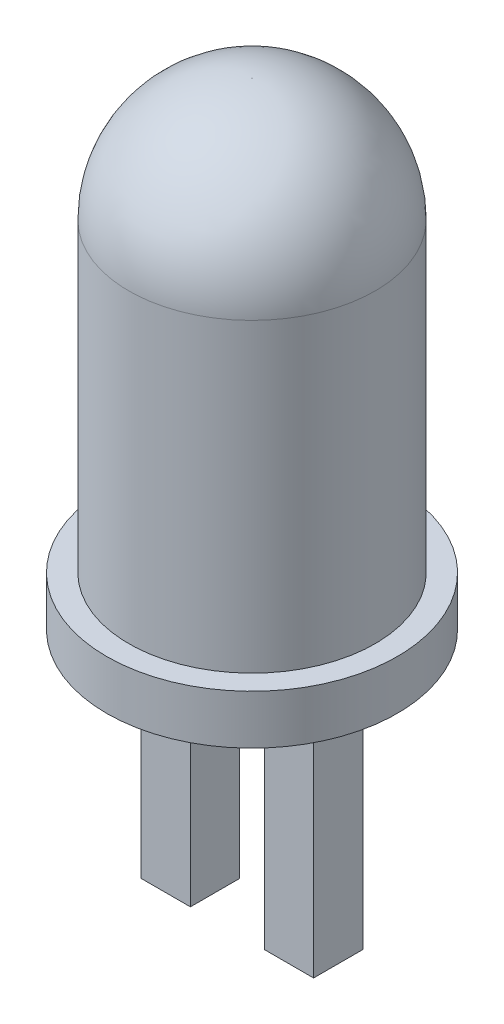
ISO-10303-21;
HEADER;
FILE_DESCRIPTION(('STEP AP214'),'2;1');
FILE_NAME('part.step','',(''),(''),'','','');
FILE_SCHEMA(('AUTOMOTIVE_DESIGN { 1 0 10303 214 1 1 1 1 }'));
ENDSEC;
DATA;
#1=APPLICATION_CONTEXT('core data for automotive mechanical design processes');
#2=APPLICATION_PROTOCOL_DEFINITION('international standard','automotive_design',2000,#1);
#3=PRODUCT_CONTEXT('',#1,'mechanical');
#4=PRODUCT('Part','Part','',(#3));
#5=PRODUCT_RELATED_PRODUCT_CATEGORY('part','',(#4));
#6=PRODUCT_DEFINITION_FORMATION('','',#4);
#7=PRODUCT_DEFINITION_CONTEXT('part definition',#1,'design');
#8=PRODUCT_DEFINITION('design','',#6,#7);
#9=PRODUCT_DEFINITION_SHAPE('','',#8);
#10=(LENGTH_UNIT() NAMED_UNIT(*) SI_UNIT(.MILLI.,.METRE.));
#11=(NAMED_UNIT(*) PLANE_ANGLE_UNIT() SI_UNIT($,.RADIAN.));
#12=(NAMED_UNIT(*) SI_UNIT($,.STERADIAN.) SOLID_ANGLE_UNIT());
#13=UNCERTAINTY_MEASURE_WITH_UNIT(LENGTH_MEASURE(1.E-05),#10,'distance_accuracy_value','');
#14=(GEOMETRIC_REPRESENTATION_CONTEXT(3) GLOBAL_UNCERTAINTY_ASSIGNED_CONTEXT((#13)) GLOBAL_UNIT_ASSIGNED_CONTEXT((#10,
#11,#12)) REPRESENTATION_CONTEXT('',''));
#15=CARTESIAN_POINT('',(0.,0.,0.));
#16=DIRECTION('',(0.,0.,1.));
#17=DIRECTION('',(1.,0.,0.));
#18=AXIS2_PLACEMENT_3D('',#15,#16,#17);
#19=CARTESIAN_POINT('',(0.,0.,0.));
#20=DIRECTION('',(0.,1.,0.));
#21=DIRECTION('',(0.,0.,1.));
#22=AXIS2_PLACEMENT_3D('',#19,#20,#21);
#23=PLANE('',#22);
#24=DIRECTION('',(0.,0.,1.));
#25=VECTOR('',#24,1.);
#26=CARTESIAN_POINT('',(-0.749999999999999,0.,-0.5));
#27=LINE('',#26,#25);
#28=CARTESIAN_POINT('',(-0.749999999999999,0.,-0.5));
#29=VERTEX_POINT('',#28);
#30=CARTESIAN_POINT('',(-0.749999999999999,0.,0.5));
#31=VERTEX_POINT('',#30);
#32=EDGE_CURVE('E121',#29,#31,#27,.T.);
#33=ORIENTED_EDGE('',*,*,#32,.F.);
#34=DIRECTION('',(1.,0.,0.));
#35=VECTOR('',#34,1.);
#36=CARTESIAN_POINT('',(-1.75,0.,-0.5));
#37=LINE('',#36,#35);
#38=CARTESIAN_POINT('',(-1.75,0.,-0.5));
#39=VERTEX_POINT('',#38);
#40=EDGE_CURVE('E134',#39,#29,#37,.T.);
#41=ORIENTED_EDGE('',*,*,#40,.F.);
#42=DIRECTION('',(0.,0.,-1.));
#43=VECTOR('',#42,1.);
#44=CARTESIAN_POINT('',(-1.75,0.,-0.5));
#45=LINE('',#44,#43);
#46=CARTESIAN_POINT('',(-1.75,0.,0.5));
#47=VERTEX_POINT('',#46);
#48=EDGE_CURVE('E143',#47,#39,#45,.T.);
#49=ORIENTED_EDGE('',*,*,#48,.F.);
#50=DIRECTION('',(-1.,0.,0.));
#51=VECTOR('',#50,1.);
#52=CARTESIAN_POINT('',(-1.75,0.,0.5));
#53=LINE('',#52,#51);
#54=EDGE_CURVE('E124',#31,#47,#53,.T.);
#55=ORIENTED_EDGE('',*,*,#54,.F.);
#56=EDGE_LOOP('',(#33,#41,#49,#55));
#57=FACE_BOUND('',#56,.T.);
#58=CARTESIAN_POINT('',(0.,0.,0.));
#59=DIRECTION('',(0.,-1.,0.));
#60=DIRECTION('',(0.,0.,-1.));
#61=AXIS2_PLACEMENT_3D('',#58,#59,#60);
#62=CIRCLE('',#61,2.95);
#63=CARTESIAN_POINT('',(0.,0.,-2.95));
#64=VERTEX_POINT('',#63);
#65=EDGE_CURVE('E159',#64,#64,#62,.T.);
#66=ORIENTED_EDGE('',*,*,#65,.T.);
#67=EDGE_LOOP('',(#66));
#68=FACE_BOUND('',#67,.T.);
#69=DIRECTION('',(0.,0.,1.));
#70=VECTOR('',#69,1.);
#71=CARTESIAN_POINT('',(1.75,0.,-0.5));
#72=LINE('',#71,#70);
#73=CARTESIAN_POINT('',(1.75,0.,-0.5));
#74=VERTEX_POINT('',#73);
#75=CARTESIAN_POINT('',(1.75,0.,0.5));
#76=VERTEX_POINT('',#75);
#77=EDGE_CURVE('E120',#74,#76,#72,.T.);
#78=ORIENTED_EDGE('',*,*,#77,.F.);
#79=DIRECTION('',(1.,0.,0.));
#80=VECTOR('',#79,1.);
#81=CARTESIAN_POINT('',(0.750000000000001,0.,-0.5));
#82=LINE('',#81,#80);
#83=CARTESIAN_POINT('',(0.750000000000001,0.,-0.5));
#84=VERTEX_POINT('',#83);
#85=EDGE_CURVE('E117',#84,#74,#82,.T.);
#86=ORIENTED_EDGE('',*,*,#85,.F.);
#87=DIRECTION('',(0.,0.,-1.));
#88=VECTOR('',#87,1.);
#89=CARTESIAN_POINT('',(0.750000000000001,0.,-0.5));
#90=LINE('',#89,#88);
#91=CARTESIAN_POINT('',(0.750000000000001,0.,0.5));
#92=VERTEX_POINT('',#91);
#93=EDGE_CURVE('E55',#92,#84,#90,.T.);
#94=ORIENTED_EDGE('',*,*,#93,.F.);
#95=DIRECTION('',(-1.,0.,0.));
#96=VECTOR('',#95,1.);
#97=CARTESIAN_POINT('',(0.750000000000001,0.,0.5));
#98=LINE('',#97,#96);
#99=EDGE_CURVE('E50',#76,#92,#98,.T.);
#100=ORIENTED_EDGE('',*,*,#99,.F.);
#101=EDGE_LOOP('',(#78,#86,#94,#100));
#102=FACE_BOUND('',#101,.T.);
#103=ADVANCED_FACE('F36',(#57,#68,#102),#23,.F.);
#104=CARTESIAN_POINT('',(0.,9.69,0.00999999999998225));
#105=DIRECTION('',(0.,-1.,0.));
#106=DIRECTION('',(0.,0.,-1.));
#107=AXIS2_PLACEMENT_3D('',#104,#105,#106);
#108=PLANE('',#107);
#109=CARTESIAN_POINT('',(0.,9.69,0.));
#110=DIRECTION('',(0.,-1.,0.));
#111=DIRECTION('',(0.,0.,-1.));
#112=AXIS2_PLACEMENT_3D('',#109,#110,#111);
#113=CIRCLE('',#112,0.00999999999998225);
#114=CARTESIAN_POINT('',(0.,9.69,-0.00999999999998225));
#115=VERTEX_POINT('',#114);
#116=EDGE_CURVE('E11',#115,#115,#113,.T.);
#117=ORIENTED_EDGE('',*,*,#116,.F.);
#118=EDGE_LOOP('',(#117));
#119=FACE_BOUND('',#118,.T.);
#120=ADVANCED_FACE('F175',(#119),#108,.F.);
#121=CARTESIAN_POINT('',(0.,7.2,0.));
#122=DIRECTION('',(0.,-1.,0.));
#123=DIRECTION('',(0.,0.,-1.));
#124=AXIS2_PLACEMENT_3D('',#121,#122,#123);
#125=DEGENERATE_TOROIDAL_SURFACE('',#124,0.0100000000000005,2.49,.T.);
#126=CARTESIAN_POINT('',(0.,7.19999999999998,0.));
#127=DIRECTION('',(0.,-1.,0.));
#128=DIRECTION('',(0.,0.,-1.));
#129=AXIS2_PLACEMENT_3D('',#126,#127,#128);
#130=CIRCLE('',#129,2.5);
#131=CARTESIAN_POINT('',(0.,7.19999999999998,-2.5));
#132=VERTEX_POINT('',#131);
#133=EDGE_CURVE('E43',#132,#132,#130,.T.);
#134=ORIENTED_EDGE('',*,*,#133,.F.);
#135=EDGE_LOOP('',(#134));
#136=FACE_BOUND('',#135,.T.);
#137=ORIENTED_EDGE('',*,*,#116,.T.);
#138=EDGE_LOOP('',(#137));
#139=FACE_BOUND('',#138,.T.);
#140=ADVANCED_FACE('F172',(#136,#139),#125,.T.);
#141=CARTESIAN_POINT('',(0.,0.,0.));
#142=DIRECTION('',(0.,-1.,0.));
#143=DIRECTION('',(0.,0.,-1.));
#144=AXIS2_PLACEMENT_3D('',#141,#142,#143);
#145=CYLINDRICAL_SURFACE('',#144,2.5);
#146=CARTESIAN_POINT('',(0.,1.,0.));
#147=DIRECTION('',(0.,-1.,0.));
#148=DIRECTION('',(0.,0.,-1.));
#149=AXIS2_PLACEMENT_3D('',#146,#147,#148);
#150=CIRCLE('',#149,2.5);
#151=CARTESIAN_POINT('',(0.,1.,-2.5));
#152=VERTEX_POINT('',#151);
#153=EDGE_CURVE('E165',#152,#152,#150,.T.);
#154=ORIENTED_EDGE('',*,*,#153,.F.);
#155=EDGE_LOOP('',(#154));
#156=FACE_BOUND('',#155,.T.);
#157=ORIENTED_EDGE('',*,*,#133,.T.);
#158=EDGE_LOOP('',(#157));
#159=FACE_BOUND('',#158,.T.);
#160=ADVANCED_FACE('F170',(#156,#159),#145,.T.);
#161=CARTESIAN_POINT('',(0.,1.,2.95));
#162=DIRECTION('',(0.,-1.,0.));
#163=DIRECTION('',(0.,0.,-1.));
#164=AXIS2_PLACEMENT_3D('',#161,#162,#163);
#165=PLANE('',#164);
#166=CARTESIAN_POINT('',(0.,1.,0.));
#167=DIRECTION('',(0.,-1.,0.));
#168=DIRECTION('',(0.,0.,-1.));
#169=AXIS2_PLACEMENT_3D('',#166,#167,#168);
#170=CIRCLE('',#169,2.95);
#171=CARTESIAN_POINT('',(0.,1.,-2.95));
#172=VERTEX_POINT('',#171);
#173=EDGE_CURVE('E162',#172,#172,#170,.T.);
#174=ORIENTED_EDGE('',*,*,#173,.F.);
#175=EDGE_LOOP('',(#174));
#176=FACE_BOUND('',#175,.T.);
#177=ORIENTED_EDGE('',*,*,#153,.T.);
#178=EDGE_LOOP('',(#177));
#179=FACE_BOUND('',#178,.T.);
#180=ADVANCED_FACE('F187',(#176,#179),#165,.F.);
#181=CARTESIAN_POINT('',(0.,0.,0.));
#182=DIRECTION('',(0.,-1.,0.));
#183=DIRECTION('',(0.,0.,-1.));
#184=AXIS2_PLACEMENT_3D('',#181,#182,#183);
#185=CYLINDRICAL_SURFACE('',#184,2.95);
#186=ORIENTED_EDGE('',*,*,#65,.F.);
#187=EDGE_LOOP('',(#186));
#188=FACE_BOUND('',#187,.T.);
#189=ORIENTED_EDGE('',*,*,#173,.T.);
#190=EDGE_LOOP('',(#189));
#191=FACE_BOUND('',#190,.T.);
#192=ADVANCED_FACE('F191',(#188,#191),#185,.T.);
#193=CARTESIAN_POINT('',(-0.749999999999999,-5.,-0.5));
#194=DIRECTION('',(-1.,0.,0.));
#195=DIRECTION('',(0.,0.,1.));
#196=AXIS2_PLACEMENT_3D('',#193,#194,#195);
#197=PLANE('',#196);
#198=ORIENTED_EDGE('',*,*,#32,.T.);
#199=DIRECTION('',(0.,1.,0.));
#200=VECTOR('',#199,1.);
#201=CARTESIAN_POINT('',(-0.749999999999999,-5.,0.5));
#202=LINE('',#201,#200);
#203=CARTESIAN_POINT('',(-0.749999999999999,-5.,0.5));
#204=VERTEX_POINT('',#203);
#205=EDGE_CURVE('E156',#204,#31,#202,.T.);
#206=ORIENTED_EDGE('',*,*,#205,.F.);
#207=DIRECTION('',(0.,0.,1.));
#208=VECTOR('',#207,1.);
#209=CARTESIAN_POINT('',(-0.749999999999999,-5.,-0.5));
#210=LINE('',#209,#208);
#211=CARTESIAN_POINT('',(-0.749999999999999,-5.,-0.5));
#212=VERTEX_POINT('',#211);
#213=EDGE_CURVE('E130',#212,#204,#210,.T.);
#214=ORIENTED_EDGE('',*,*,#213,.F.);
#215=DIRECTION('',(0.,1.,0.));
#216=VECTOR('',#215,1.);
#217=CARTESIAN_POINT('',(-0.749999999999999,-5.,-0.5));
#218=LINE('',#217,#216);
#219=EDGE_CURVE('E139',#212,#29,#218,.T.);
#220=ORIENTED_EDGE('',*,*,#219,.T.);
#221=EDGE_LOOP('',(#198,#206,#214,#220));
#222=FACE_BOUND('',#221,.T.);
#223=ADVANCED_FACE('F195',(#222),#197,.F.);
#224=CARTESIAN_POINT('',(-1.75,-5.,0.5));
#225=DIRECTION('',(0.,0.,-1.));
#226=DIRECTION('',(-1.,0.,0.));
#227=AXIS2_PLACEMENT_3D('',#224,#225,#226);
#228=PLANE('',#227);
#229=ORIENTED_EDGE('',*,*,#54,.T.);
#230=DIRECTION('',(0.,1.,0.));
#231=VECTOR('',#230,1.);
#232=CARTESIAN_POINT('',(-1.75,-5.,0.5));
#233=LINE('',#232,#231);
#234=CARTESIAN_POINT('',(-1.75,-5.,0.5));
#235=VERTEX_POINT('',#234);
#236=EDGE_CURVE('E153',#235,#47,#233,.T.);
#237=ORIENTED_EDGE('',*,*,#236,.F.);
#238=DIRECTION('',(-1.,0.,0.));
#239=VECTOR('',#238,1.);
#240=CARTESIAN_POINT('',(-1.75,-5.,0.5));
#241=LINE('',#240,#239);
#242=EDGE_CURVE('E133',#204,#235,#241,.T.);
#243=ORIENTED_EDGE('',*,*,#242,.F.);
#244=ORIENTED_EDGE('',*,*,#205,.T.);
#245=EDGE_LOOP('',(#229,#237,#243,#244));
#246=FACE_BOUND('',#245,.T.);
#247=ADVANCED_FACE('F199',(#246),#228,.F.);
#248=CARTESIAN_POINT('',(-1.75,-5.,-0.5));
#249=DIRECTION('',(1.,0.,0.));
#250=DIRECTION('',(0.,0.,-1.));
#251=AXIS2_PLACEMENT_3D('',#248,#249,#250);
#252=PLANE('',#251);
#253=ORIENTED_EDGE('',*,*,#48,.T.);
#254=DIRECTION('',(0.,1.,0.));
#255=VECTOR('',#254,1.);
#256=CARTESIAN_POINT('',(-1.75,-5.,-0.5));
#257=LINE('',#256,#255);
#258=CARTESIAN_POINT('',(-1.75,-5.,-0.5));
#259=VERTEX_POINT('',#258);
#260=EDGE_CURVE('E150',#259,#39,#257,.T.);
#261=ORIENTED_EDGE('',*,*,#260,.F.);
#262=DIRECTION('',(0.,0.,-1.));
#263=VECTOR('',#262,1.);
#264=CARTESIAN_POINT('',(-1.75,-5.,-0.5));
#265=LINE('',#264,#263);
#266=EDGE_CURVE('E136',#235,#259,#265,.T.);
#267=ORIENTED_EDGE('',*,*,#266,.F.);
#268=ORIENTED_EDGE('',*,*,#236,.T.);
#269=EDGE_LOOP('',(#253,#261,#267,#268));
#270=FACE_BOUND('',#269,.T.);
#271=ADVANCED_FACE('F203',(#270),#252,.F.);
#272=CARTESIAN_POINT('',(-1.75,-5.,-0.5));
#273=DIRECTION('',(0.,0.,1.));
#274=DIRECTION('',(1.,0.,0.));
#275=AXIS2_PLACEMENT_3D('',#272,#273,#274);
#276=PLANE('',#275);
#277=ORIENTED_EDGE('',*,*,#40,.T.);
#278=ORIENTED_EDGE('',*,*,#219,.F.);
#279=DIRECTION('',(1.,0.,0.));
#280=VECTOR('',#279,1.);
#281=CARTESIAN_POINT('',(-1.75,-5.,-0.5));
#282=LINE('',#281,#280);
#283=EDGE_CURVE('E138',#259,#212,#282,.T.);
#284=ORIENTED_EDGE('',*,*,#283,.F.);
#285=ORIENTED_EDGE('',*,*,#260,.T.);
#286=EDGE_LOOP('',(#277,#278,#284,#285));
#287=FACE_BOUND('',#286,.T.);
#288=ADVANCED_FACE('F207',(#287),#276,.F.);
#289=CARTESIAN_POINT('',(0.,-5.,0.));
#290=DIRECTION('',(0.,1.,0.));
#291=DIRECTION('',(0.,0.,1.));
#292=AXIS2_PLACEMENT_3D('',#289,#290,#291);
#293=PLANE('',#292);
#294=ORIENTED_EDGE('',*,*,#213,.T.);
#295=ORIENTED_EDGE('',*,*,#242,.T.);
#296=ORIENTED_EDGE('',*,*,#266,.T.);
#297=ORIENTED_EDGE('',*,*,#283,.T.);
#298=EDGE_LOOP('',(#294,#295,#296,#297));
#299=FACE_BOUND('',#298,.T.);
#300=ADVANCED_FACE('F211',(#299),#293,.F.);
#301=CARTESIAN_POINT('',(1.75,-5.,-0.5));
#302=DIRECTION('',(-1.,0.,0.));
#303=DIRECTION('',(0.,0.,1.));
#304=AXIS2_PLACEMENT_3D('',#301,#302,#303);
#305=PLANE('',#304);
#306=ORIENTED_EDGE('',*,*,#77,.T.);
#307=DIRECTION('',(0.,1.,0.));
#308=VECTOR('',#307,1.);
#309=CARTESIAN_POINT('',(1.75,-5.,0.5));
#310=LINE('',#309,#308);
#311=CARTESIAN_POINT('',(1.75,-5.,0.5));
#312=VERTEX_POINT('',#311);
#313=EDGE_CURVE('E101',#312,#76,#310,.T.);
#314=ORIENTED_EDGE('',*,*,#313,.F.);
#315=DIRECTION('',(0.,0.,1.));
#316=VECTOR('',#315,1.);
#317=CARTESIAN_POINT('',(1.75,-5.,-0.5));
#318=LINE('',#317,#316);
#319=CARTESIAN_POINT('',(1.75,-5.,-0.5));
#320=VERTEX_POINT('',#319);
#321=EDGE_CURVE('E108',#320,#312,#318,.T.);
#322=ORIENTED_EDGE('',*,*,#321,.F.);
#323=DIRECTION('',(0.,1.,0.));
#324=VECTOR('',#323,1.);
#325=CARTESIAN_POINT('',(1.75,-5.,-0.5));
#326=LINE('',#325,#324);
#327=EDGE_CURVE('E325',#320,#74,#326,.T.);
#328=ORIENTED_EDGE('',*,*,#327,.T.);
#329=EDGE_LOOP('',(#306,#314,#322,#328));
#330=FACE_BOUND('',#329,.T.);
#331=ADVANCED_FACE('F119',(#330),#305,.F.);
#332=CARTESIAN_POINT('',(0.750000000000001,-5.,0.5));
#333=DIRECTION('',(0.,0.,-1.));
#334=DIRECTION('',(-1.,0.,0.));
#335=AXIS2_PLACEMENT_3D('',#332,#333,#334);
#336=PLANE('',#335);
#337=ORIENTED_EDGE('',*,*,#99,.T.);
#338=DIRECTION('',(0.,1.,0.));
#339=VECTOR('',#338,1.);
#340=CARTESIAN_POINT('',(0.750000000000001,-5.,0.5));
#341=LINE('',#340,#339);
#342=CARTESIAN_POINT('',(0.750000000000001,-5.,0.5));
#343=VERTEX_POINT('',#342);
#344=EDGE_CURVE('E104',#343,#92,#341,.T.);
#345=ORIENTED_EDGE('',*,*,#344,.F.);
#346=DIRECTION('',(-1.,0.,0.));
#347=VECTOR('',#346,1.);
#348=CARTESIAN_POINT('',(0.750000000000001,-5.,0.5));
#349=LINE('',#348,#347);
#350=EDGE_CURVE('E97',#312,#343,#349,.T.);
#351=ORIENTED_EDGE('',*,*,#350,.F.);
#352=ORIENTED_EDGE('',*,*,#313,.T.);
#353=EDGE_LOOP('',(#337,#345,#351,#352));
#354=FACE_BOUND('',#353,.T.);
#355=ADVANCED_FACE('F99',(#354),#336,.F.);
#356=CARTESIAN_POINT('',(0.750000000000001,-5.,-0.5));
#357=DIRECTION('',(1.,0.,0.));
#358=DIRECTION('',(0.,0.,-1.));
#359=AXIS2_PLACEMENT_3D('',#356,#357,#358);
#360=PLANE('',#359);
#361=ORIENTED_EDGE('',*,*,#93,.T.);
#362=DIRECTION('',(0.,1.,0.));
#363=VECTOR('',#362,1.);
#364=CARTESIAN_POINT('',(0.750000000000001,-5.,-0.5));
#365=LINE('',#364,#363);
#366=CARTESIAN_POINT('',(0.750000000000001,-5.,-0.5));
#367=VERTEX_POINT('',#366);
#368=EDGE_CURVE('E126',#367,#84,#365,.T.);
#369=ORIENTED_EDGE('',*,*,#368,.F.);
#370=DIRECTION('',(0.,0.,-1.));
#371=VECTOR('',#370,1.);
#372=CARTESIAN_POINT('',(0.750000000000001,-5.,-0.5));
#373=LINE('',#372,#371);
#374=EDGE_CURVE('E107',#343,#367,#373,.T.);
#375=ORIENTED_EDGE('',*,*,#374,.F.);
#376=ORIENTED_EDGE('',*,*,#344,.T.);
#377=EDGE_LOOP('',(#361,#369,#375,#376));
#378=FACE_BOUND('',#377,.T.);
#379=ADVANCED_FACE('F220',(#378),#360,.F.);
#380=CARTESIAN_POINT('',(0.750000000000001,-5.,-0.5));
#381=DIRECTION('',(0.,0.,1.));
#382=DIRECTION('',(1.,0.,0.));
#383=AXIS2_PLACEMENT_3D('',#380,#381,#382);
#384=PLANE('',#383);
#385=ORIENTED_EDGE('',*,*,#85,.T.);
#386=ORIENTED_EDGE('',*,*,#327,.F.);
#387=DIRECTION('',(1.,0.,0.));
#388=VECTOR('',#387,1.);
#389=CARTESIAN_POINT('',(0.750000000000001,-5.,-0.5));
#390=LINE('',#389,#388);
#391=EDGE_CURVE('E113',#367,#320,#390,.T.);
#392=ORIENTED_EDGE('',*,*,#391,.F.);
#393=ORIENTED_EDGE('',*,*,#368,.T.);
#394=EDGE_LOOP('',(#385,#386,#392,#393));
#395=FACE_BOUND('',#394,.T.);
#396=ADVANCED_FACE('F223',(#395),#384,.F.);
#397=CARTESIAN_POINT('',(0.,-5.,0.));
#398=DIRECTION('',(0.,1.,0.));
#399=DIRECTION('',(0.,0.,1.));
#400=AXIS2_PLACEMENT_3D('',#397,#398,#399);
#401=PLANE('',#400);
#402=ORIENTED_EDGE('',*,*,#321,.T.);
#403=ORIENTED_EDGE('',*,*,#350,.T.);
#404=ORIENTED_EDGE('',*,*,#374,.T.);
#405=ORIENTED_EDGE('',*,*,#391,.T.);
#406=EDGE_LOOP('',(#402,#403,#404,#405));
#407=FACE_BOUND('',#406,.T.);
#408=ADVANCED_FACE('F111',(#407),#401,.F.);
#409=CLOSED_SHELL('',(#103,#120,#140,#160,#180,#192,#223,#247,#271,#288,#300,#331,#355,#379,
#396,#408));
#410=MANIFOLD_SOLID_BREP('B2',#409);
#411=ADVANCED_BREP_SHAPE_REPRESENTATION('',(#18,#410),#14);
#412=SHAPE_DEFINITION_REPRESENTATION(#9,#411);
ENDSEC;
END-ISO-10303-21;
